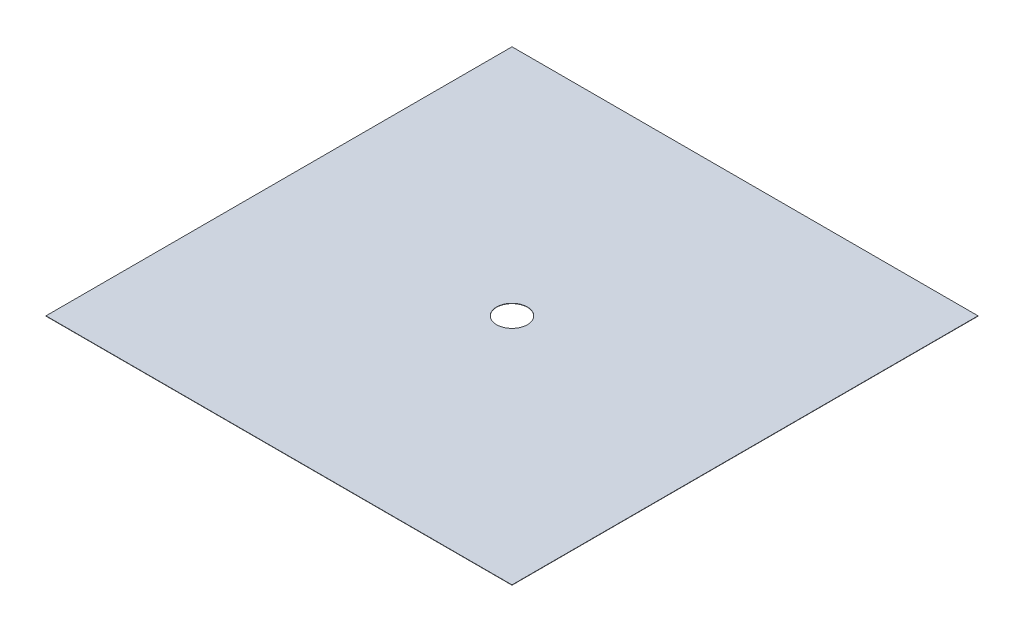
ISO-10303-21;
HEADER;
FILE_DESCRIPTION(('STEP AP214'),'2;1');
FILE_NAME('part.step','',(''),(''),'','','');
FILE_SCHEMA(('AUTOMOTIVE_DESIGN { 1 0 10303 214 1 1 1 1 }'));
ENDSEC;
DATA;
#1=APPLICATION_CONTEXT('core data for automotive mechanical design processes');
#2=APPLICATION_PROTOCOL_DEFINITION('international standard','automotive_design',2000,#1);
#3=PRODUCT_CONTEXT('',#1,'mechanical');
#4=PRODUCT('Part','Part','',(#3));
#5=PRODUCT_RELATED_PRODUCT_CATEGORY('part','',(#4));
#6=PRODUCT_DEFINITION_FORMATION('','',#4);
#7=PRODUCT_DEFINITION_CONTEXT('part definition',#1,'design');
#8=PRODUCT_DEFINITION('design','',#6,#7);
#9=PRODUCT_DEFINITION_SHAPE('','',#8);
#10=(LENGTH_UNIT() NAMED_UNIT(*) SI_UNIT(.MILLI.,.METRE.));
#11=(NAMED_UNIT(*) PLANE_ANGLE_UNIT() SI_UNIT($,.RADIAN.));
#12=(NAMED_UNIT(*) SI_UNIT($,.STERADIAN.) SOLID_ANGLE_UNIT());
#13=UNCERTAINTY_MEASURE_WITH_UNIT(LENGTH_MEASURE(1.E-05),#10,'distance_accuracy_value','');
#14=(GEOMETRIC_REPRESENTATION_CONTEXT(3) GLOBAL_UNCERTAINTY_ASSIGNED_CONTEXT((#13)) GLOBAL_UNIT_ASSIGNED_CONTEXT((#10,
#11,#12)) REPRESENTATION_CONTEXT('',''));
#15=CARTESIAN_POINT('',(0.,0.,0.));
#16=DIRECTION('',(0.,0.,1.));
#17=DIRECTION('',(1.,0.,0.));
#18=AXIS2_PLACEMENT_3D('',#15,#16,#17);
#19=CARTESIAN_POINT('',(0.,0.35,0.));
#20=DIRECTION('',(0.,-1.,0.));
#21=DIRECTION('',(0.,0.,-1.));
#22=AXIS2_PLACEMENT_3D('',#19,#20,#21);
#23=PLANE('',#22);
#24=DIRECTION('',(0.,0.,-1.));
#25=VECTOR('',#24,1.);
#26=CARTESIAN_POINT('',(0.,0.35,-530.));
#27=LINE('',#26,#25);
#28=CARTESIAN_POINT('',(0.,0.35,0.));
#29=VERTEX_POINT('',#28);
#30=CARTESIAN_POINT('',(0.,0.35,-530.));
#31=VERTEX_POINT('',#30);
#32=EDGE_CURVE('E92',#29,#31,#27,.T.);
#33=ORIENTED_EDGE('',*,*,#32,.T.);
#34=DIRECTION('',(-1.,0.,0.));
#35=VECTOR('',#34,1.);
#36=CARTESIAN_POINT('',(-530.,0.35,-530.));
#37=LINE('',#36,#35);
#38=CARTESIAN_POINT('',(-530.,0.35,-530.));
#39=VERTEX_POINT('',#38);
#40=EDGE_CURVE('E87',#31,#39,#37,.T.);
#41=ORIENTED_EDGE('',*,*,#40,.T.);
#42=DIRECTION('',(0.,0.,1.));
#43=VECTOR('',#42,1.);
#44=CARTESIAN_POINT('',(-530.,0.35,0.));
#45=LINE('',#44,#43);
#46=CARTESIAN_POINT('',(-530.,0.35,0.));
#47=VERTEX_POINT('',#46);
#48=EDGE_CURVE('E90',#39,#47,#45,.T.);
#49=ORIENTED_EDGE('',*,*,#48,.T.);
#50=DIRECTION('',(1.,0.,0.));
#51=VECTOR('',#50,1.);
#52=CARTESIAN_POINT('',(0.,0.35,0.));
#53=LINE('',#52,#51);
#54=EDGE_CURVE('E57',#47,#29,#53,.T.);
#55=ORIENTED_EDGE('',*,*,#54,.T.);
#56=EDGE_LOOP('',(#33,#41,#49,#55));
#57=FACE_BOUND('',#56,.T.);
#58=CARTESIAN_POINT('',(-265.,0.35,-265.));
#59=DIRECTION('',(0.,1.,0.));
#60=DIRECTION('',(0.,0.,1.));
#61=AXIS2_PLACEMENT_3D('',#58,#59,#60);
#62=CIRCLE('',#61,17.5);
#63=CARTESIAN_POINT('',(-265.,0.35,-247.5));
#64=VERTEX_POINT('',#63);
#65=EDGE_CURVE('E112',#64,#64,#62,.T.);
#66=ORIENTED_EDGE('',*,*,#65,.F.);
#67=EDGE_LOOP('',(#66));
#68=FACE_BOUND('',#67,.T.);
#69=ADVANCED_FACE('F39',(#57,#68),#23,.F.);
#70=CARTESIAN_POINT('',(0.,0.,0.));
#71=DIRECTION('',(0.,-1.,0.));
#72=DIRECTION('',(0.,0.,-1.));
#73=AXIS2_PLACEMENT_3D('',#70,#71,#72);
#74=PLANE('',#73);
#75=DIRECTION('',(0.,0.,-1.));
#76=VECTOR('',#75,1.);
#77=CARTESIAN_POINT('',(0.,0.,-530.));
#78=LINE('',#77,#76);
#79=CARTESIAN_POINT('',(0.,0.,0.));
#80=VERTEX_POINT('',#79);
#81=CARTESIAN_POINT('',(0.,0.,-530.));
#82=VERTEX_POINT('',#81);
#83=EDGE_CURVE('E108',#80,#82,#78,.T.);
#84=ORIENTED_EDGE('',*,*,#83,.F.);
#85=DIRECTION('',(1.,0.,0.));
#86=VECTOR('',#85,1.);
#87=CARTESIAN_POINT('',(0.,0.,0.));
#88=LINE('',#87,#86);
#89=CARTESIAN_POINT('',(-530.,0.,0.));
#90=VERTEX_POINT('',#89);
#91=EDGE_CURVE('E80',#90,#80,#88,.T.);
#92=ORIENTED_EDGE('',*,*,#91,.F.);
#93=DIRECTION('',(0.,0.,1.));
#94=VECTOR('',#93,1.);
#95=CARTESIAN_POINT('',(-530.,0.,0.));
#96=LINE('',#95,#94);
#97=CARTESIAN_POINT('',(-530.,0.,-530.));
#98=VERTEX_POINT('',#97);
#99=EDGE_CURVE('E74',#98,#90,#96,.T.);
#100=ORIENTED_EDGE('',*,*,#99,.F.);
#101=DIRECTION('',(-1.,0.,0.));
#102=VECTOR('',#101,1.);
#103=CARTESIAN_POINT('',(-530.,0.,-530.));
#104=LINE('',#103,#102);
#105=EDGE_CURVE('E97',#82,#98,#104,.T.);
#106=ORIENTED_EDGE('',*,*,#105,.F.);
#107=EDGE_LOOP('',(#84,#92,#100,#106));
#108=FACE_BOUND('',#107,.T.);
#109=CARTESIAN_POINT('',(-265.,0.,-265.));
#110=DIRECTION('',(0.,1.,0.));
#111=DIRECTION('',(0.,0.,1.));
#112=AXIS2_PLACEMENT_3D('',#109,#110,#111);
#113=CIRCLE('',#112,17.5);
#114=CARTESIAN_POINT('',(-265.,0.,-247.5));
#115=VERTEX_POINT('',#114);
#116=EDGE_CURVE('E130',#115,#115,#113,.T.);
#117=ORIENTED_EDGE('',*,*,#116,.T.);
#118=EDGE_LOOP('',(#117));
#119=FACE_BOUND('',#118,.T.);
#120=ADVANCED_FACE('F125',(#108,#119),#74,.T.);
#121=CARTESIAN_POINT('',(0.,0.35,-530.));
#122=DIRECTION('',(-1.,0.,0.));
#123=DIRECTION('',(0.,0.,1.));
#124=AXIS2_PLACEMENT_3D('',#121,#122,#123);
#125=PLANE('',#124);
#126=ORIENTED_EDGE('',*,*,#83,.T.);
#127=DIRECTION('',(0.,-1.,0.));
#128=VECTOR('',#127,1.);
#129=CARTESIAN_POINT('',(0.,0.35,-530.));
#130=LINE('',#129,#128);
#131=EDGE_CURVE('E11',#31,#82,#130,.T.);
#132=ORIENTED_EDGE('',*,*,#131,.F.);
#133=ORIENTED_EDGE('',*,*,#32,.F.);
#134=DIRECTION('',(0.,-1.,0.));
#135=VECTOR('',#134,1.);
#136=CARTESIAN_POINT('',(0.,0.35,0.));
#137=LINE('',#136,#135);
#138=EDGE_CURVE('E104',#29,#80,#137,.T.);
#139=ORIENTED_EDGE('',*,*,#138,.T.);
#140=EDGE_LOOP('',(#126,#132,#133,#139));
#141=FACE_BOUND('',#140,.T.);
#142=ADVANCED_FACE('F41',(#141),#125,.F.);
#143=CARTESIAN_POINT('',(-530.,0.35,-530.));
#144=DIRECTION('',(0.,0.,1.));
#145=DIRECTION('',(1.,0.,0.));
#146=AXIS2_PLACEMENT_3D('',#143,#144,#145);
#147=PLANE('',#146);
#148=ORIENTED_EDGE('',*,*,#105,.T.);
#149=DIRECTION('',(0.,-1.,0.));
#150=VECTOR('',#149,1.);
#151=CARTESIAN_POINT('',(-530.,0.35,-530.));
#152=LINE('',#151,#150);
#153=EDGE_CURVE('E49',#39,#98,#152,.T.);
#154=ORIENTED_EDGE('',*,*,#153,.F.);
#155=ORIENTED_EDGE('',*,*,#40,.F.);
#156=ORIENTED_EDGE('',*,*,#131,.T.);
#157=EDGE_LOOP('',(#148,#154,#155,#156));
#158=FACE_BOUND('',#157,.T.);
#159=ADVANCED_FACE('F96',(#158),#147,.F.);
#160=CARTESIAN_POINT('',(-530.,0.35,0.));
#161=DIRECTION('',(1.,0.,0.));
#162=DIRECTION('',(0.,0.,-1.));
#163=AXIS2_PLACEMENT_3D('',#160,#161,#162);
#164=PLANE('',#163);
#165=ORIENTED_EDGE('',*,*,#99,.T.);
#166=DIRECTION('',(0.,-1.,0.));
#167=VECTOR('',#166,1.);
#168=CARTESIAN_POINT('',(-530.,0.35,0.));
#169=LINE('',#168,#167);
#170=EDGE_CURVE('E99',#47,#90,#169,.T.);
#171=ORIENTED_EDGE('',*,*,#170,.F.);
#172=ORIENTED_EDGE('',*,*,#48,.F.);
#173=ORIENTED_EDGE('',*,*,#153,.T.);
#174=EDGE_LOOP('',(#165,#171,#172,#173));
#175=FACE_BOUND('',#174,.T.);
#176=ADVANCED_FACE('F100',(#175),#164,.F.);
#177=CARTESIAN_POINT('',(0.,0.35,0.));
#178=DIRECTION('',(0.,0.,-1.));
#179=DIRECTION('',(-1.,0.,0.));
#180=AXIS2_PLACEMENT_3D('',#177,#178,#179);
#181=PLANE('',#180);
#182=ORIENTED_EDGE('',*,*,#91,.T.);
#183=ORIENTED_EDGE('',*,*,#138,.F.);
#184=ORIENTED_EDGE('',*,*,#54,.F.);
#185=ORIENTED_EDGE('',*,*,#170,.T.);
#186=EDGE_LOOP('',(#182,#183,#184,#185));
#187=FACE_BOUND('',#186,.T.);
#188=ADVANCED_FACE('F122',(#187),#181,.F.);
#189=CARTESIAN_POINT('',(-265.,0.35,-265.));
#190=DIRECTION('',(0.,-1.,0.));
#191=DIRECTION('',(0.,0.,-1.));
#192=AXIS2_PLACEMENT_3D('',#189,#190,#191);
#193=CYLINDRICAL_SURFACE('',#192,17.5);
#194=ORIENTED_EDGE('',*,*,#65,.T.);
#195=EDGE_LOOP('',(#194));
#196=FACE_BOUND('',#195,.T.);
#197=ORIENTED_EDGE('',*,*,#116,.F.);
#198=EDGE_LOOP('',(#197));
#199=FACE_BOUND('',#198,.T.);
#200=ADVANCED_FACE('F138',(#196,#199),#193,.F.);
#201=CLOSED_SHELL('',(#69,#120,#142,#159,#176,#188,#200));
#202=MANIFOLD_SOLID_BREP('B2',#201);
#203=ADVANCED_BREP_SHAPE_REPRESENTATION('',(#18,#202),#14);
#204=SHAPE_DEFINITION_REPRESENTATION(#9,#203);
ENDSEC;
END-ISO-10303-21;
